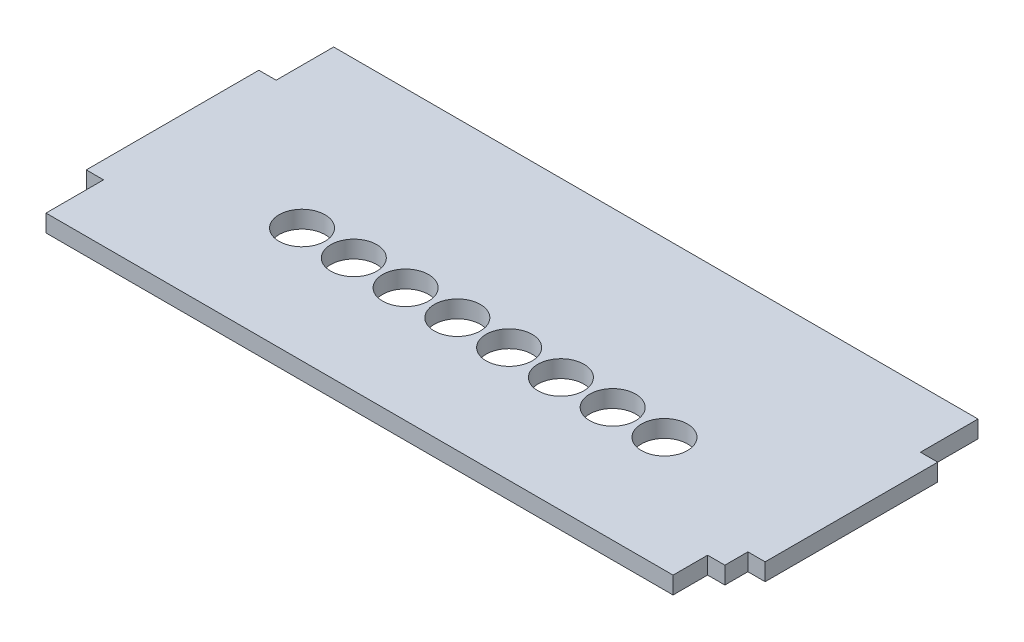
ISO-10303-21;
HEADER;
FILE_DESCRIPTION(('STEP AP214'),'2;1');
FILE_NAME('part.step','',(''),(''),'','','');
FILE_SCHEMA(('AUTOMOTIVE_DESIGN { 1 0 10303 214 1 1 1 1 }'));
ENDSEC;
DATA;
#1=APPLICATION_CONTEXT('core data for automotive mechanical design processes');
#2=APPLICATION_PROTOCOL_DEFINITION('international standard','automotive_design',2000,#1);
#3=PRODUCT_CONTEXT('',#1,'mechanical');
#4=PRODUCT('Part','Part','',(#3));
#5=PRODUCT_RELATED_PRODUCT_CATEGORY('part','',(#4));
#6=PRODUCT_DEFINITION_FORMATION('','',#4);
#7=PRODUCT_DEFINITION_CONTEXT('part definition',#1,'design');
#8=PRODUCT_DEFINITION('design','',#6,#7);
#9=PRODUCT_DEFINITION_SHAPE('','',#8);
#10=(LENGTH_UNIT() NAMED_UNIT(*) SI_UNIT(.MILLI.,.METRE.));
#11=(NAMED_UNIT(*) PLANE_ANGLE_UNIT() SI_UNIT($,.RADIAN.));
#12=(NAMED_UNIT(*) SI_UNIT($,.STERADIAN.) SOLID_ANGLE_UNIT());
#13=UNCERTAINTY_MEASURE_WITH_UNIT(LENGTH_MEASURE(1.E-05),#10,'distance_accuracy_value','');
#14=(GEOMETRIC_REPRESENTATION_CONTEXT(3) GLOBAL_UNCERTAINTY_ASSIGNED_CONTEXT((#13)) GLOBAL_UNIT_ASSIGNED_CONTEXT((#10,
#11,#12)) REPRESENTATION_CONTEXT('',''));
#15=CARTESIAN_POINT('',(0.,0.,0.));
#16=DIRECTION('',(0.,0.,1.));
#17=DIRECTION('',(1.,0.,0.));
#18=AXIS2_PLACEMENT_3D('',#15,#16,#17);
#19=CARTESIAN_POINT('',(-1.5404344466674E-12,12.,139.999999999999));
#20=DIRECTION('',(0.,0.,-1.));
#21=DIRECTION('',(-1.,0.,0.));
#22=AXIS2_PLACEMENT_3D('',#19,#20,#21);
#23=PLANE('',#22);
#24=DIRECTION('',(1.,0.,0.));
#25=VECTOR('',#24,1.);
#26=CARTESIAN_POINT('',(-1.5404344466674E-12,3.,139.999999999999));
#27=LINE('',#26,#25);
#28=CARTESIAN_POINT('',(-3.00000000000154,3.,139.999999999999));
#29=VERTEX_POINT('',#28);
#30=CARTESIAN_POINT('',(-1.5404344466674E-12,3.,139.999999999999));
#31=VERTEX_POINT('',#30);
#32=EDGE_CURVE('E48',#29,#31,#27,.T.);
#33=ORIENTED_EDGE('',*,*,#32,.F.);
#34=DIRECTION('',(0.,1.,0.));
#35=VECTOR('',#34,1.);
#36=CARTESIAN_POINT('',(-3.00000000000154,0.,139.999999999999));
#37=LINE('',#36,#35);
#38=CARTESIAN_POINT('',(-3.00000000000154,0.,139.999999999999));
#39=VERTEX_POINT('',#38);
#40=EDGE_CURVE('E177',#39,#29,#37,.T.);
#41=ORIENTED_EDGE('',*,*,#40,.F.);
#42=DIRECTION('',(1.,0.,0.));
#43=VECTOR('',#42,1.);
#44=CARTESIAN_POINT('',(-1.5404344466674E-12,0.,139.999999999999));
#45=LINE('',#44,#43);
#46=CARTESIAN_POINT('',(-1.5404344466674E-12,0.,139.999999999999));
#47=VERTEX_POINT('',#46);
#48=EDGE_CURVE('E193',#39,#47,#45,.T.);
#49=ORIENTED_EDGE('',*,*,#48,.T.);
#50=DIRECTION('',(0.,1.,0.));
#51=VECTOR('',#50,1.);
#52=CARTESIAN_POINT('',(-1.5404344466674E-12,0.,139.999999999999));
#53=LINE('',#52,#51);
#54=EDGE_CURVE('E240',#47,#31,#53,.T.);
#55=ORIENTED_EDGE('',*,*,#54,.T.);
#56=EDGE_LOOP('',(#33,#41,#49,#55));
#57=FACE_BOUND('',#56,.T.);
#58=ADVANCED_FACE('F34',(#57),#23,.F.);
#59=CARTESIAN_POINT('',(-1.62370117351429E-12,12.,109.999999999999));
#60=DIRECTION('',(0.,0.,-1.));
#61=DIRECTION('',(-1.,0.,0.));
#62=AXIS2_PLACEMENT_3D('',#59,#60,#61);
#63=PLANE('',#62);
#64=DIRECTION('',(0.,1.,0.));
#65=VECTOR('',#64,1.);
#66=CARTESIAN_POINT('',(-2.99999999999846,0.,109.999999999999));
#67=LINE('',#66,#65);
#68=CARTESIAN_POINT('',(-2.99999999999846,0.,109.999999999999));
#69=VERTEX_POINT('',#68);
#70=CARTESIAN_POINT('',(-2.99999999999846,3.,109.999999999999));
#71=VERTEX_POINT('',#70);
#72=EDGE_CURVE('E208',#69,#71,#67,.T.);
#73=ORIENTED_EDGE('',*,*,#72,.T.);
#74=DIRECTION('',(1.,0.,0.));
#75=VECTOR('',#74,1.);
#76=CARTESIAN_POINT('',(-1.62370117351429E-12,3.,109.999999999999));
#77=LINE('',#76,#75);
#78=CARTESIAN_POINT('',(-1.52395457364563E-12,3.,109.999999999999));
#79=VERTEX_POINT('',#78);
#80=EDGE_CURVE('E248',#71,#79,#77,.T.);
#81=ORIENTED_EDGE('',*,*,#80,.T.);
#82=DIRECTION('',(0.,1.,0.));
#83=VECTOR('',#82,1.);
#84=CARTESIAN_POINT('',(-3.05311331771916E-13,0.,109.999999999999));
#85=LINE('',#84,#83);
#86=CARTESIAN_POINT('',(-1.5404344466674E-12,0.,109.999999999999));
#87=VERTEX_POINT('',#86);
#88=EDGE_CURVE('E239',#87,#79,#85,.T.);
#89=ORIENTED_EDGE('',*,*,#88,.F.);
#90=DIRECTION('',(1.,0.,0.));
#91=VECTOR('',#90,1.);
#92=CARTESIAN_POINT('',(-1.62370117351429E-12,0.,109.999999999999));
#93=LINE('',#92,#91);
#94=EDGE_CURVE('E215',#69,#87,#93,.T.);
#95=ORIENTED_EDGE('',*,*,#94,.F.);
#96=EDGE_LOOP('',(#73,#81,#89,#95));
#97=FACE_BOUND('',#96,.T.);
#98=ADVANCED_FACE('F352',(#97),#63,.T.);
#99=CARTESIAN_POINT('',(-118.000000000001,12.,109.999999999999));
#100=DIRECTION('',(0.,0.,1.));
#101=DIRECTION('',(1.,0.,0.));
#102=AXIS2_PLACEMENT_3D('',#99,#100,#101);
#103=PLANE('',#102);
#104=DIRECTION('',(-1.,0.,0.));
#105=VECTOR('',#104,1.);
#106=CARTESIAN_POINT('',(-118.000000000001,3.,109.999999999999));
#107=LINE('',#106,#105);
#108=CARTESIAN_POINT('',(-115.000000000005,3.,109.999999999999));
#109=VERTEX_POINT('',#108);
#110=CARTESIAN_POINT('',(-118.000000000002,3.,109.999999999999));
#111=VERTEX_POINT('',#110);
#112=EDGE_CURVE('E132',#109,#111,#107,.T.);
#113=ORIENTED_EDGE('',*,*,#112,.F.);
#114=DIRECTION('',(0.,1.,0.));
#115=VECTOR('',#114,1.);
#116=CARTESIAN_POINT('',(-115.000000000005,0.,109.999999999999));
#117=LINE('',#116,#115);
#118=CARTESIAN_POINT('',(-115.000000000005,0.,109.999999999999));
#119=VERTEX_POINT('',#118);
#120=EDGE_CURVE('E206',#119,#109,#117,.T.);
#121=ORIENTED_EDGE('',*,*,#120,.F.);
#122=DIRECTION('',(-1.,0.,0.));
#123=VECTOR('',#122,1.);
#124=CARTESIAN_POINT('',(-118.000000000001,0.,109.999999999999));
#125=LINE('',#124,#123);
#126=CARTESIAN_POINT('',(-118.000000000001,0.,109.999999999999));
#127=VERTEX_POINT('',#126);
#128=EDGE_CURVE('E157',#119,#127,#125,.T.);
#129=ORIENTED_EDGE('',*,*,#128,.T.);
#130=DIRECTION('',(0.,1.,0.));
#131=VECTOR('',#130,1.);
#132=CARTESIAN_POINT('',(-118.000000000001,0.,109.999999999999));
#133=LINE('',#132,#131);
#134=EDGE_CURVE('E148',#127,#111,#133,.T.);
#135=ORIENTED_EDGE('',*,*,#134,.T.);
#136=EDGE_LOOP('',(#113,#121,#129,#135));
#137=FACE_BOUND('',#136,.T.);
#138=ADVANCED_FACE('F156',(#137),#103,.F.);
#139=CARTESIAN_POINT('',(-118.000000000002,12.,139.999999999999));
#140=DIRECTION('',(0.,0.,1.));
#141=DIRECTION('',(1.,0.,0.));
#142=AXIS2_PLACEMENT_3D('',#139,#140,#141);
#143=PLANE('',#142);
#144=DIRECTION('',(0.,1.,0.));
#145=VECTOR('',#144,1.);
#146=CARTESIAN_POINT('',(-115.000000000002,0.,139.999999999999));
#147=LINE('',#146,#145);
#148=CARTESIAN_POINT('',(-115.000000000002,0.,139.999999999999));
#149=VERTEX_POINT('',#148);
#150=CARTESIAN_POINT('',(-115.000000000002,3.,139.999999999999));
#151=VERTEX_POINT('',#150);
#152=EDGE_CURVE('E188',#149,#151,#147,.T.);
#153=ORIENTED_EDGE('',*,*,#152,.T.);
#154=DIRECTION('',(-1.,0.,0.));
#155=VECTOR('',#154,1.);
#156=CARTESIAN_POINT('',(-118.000000000002,3.,139.999999999999));
#157=LINE('',#156,#155);
#158=CARTESIAN_POINT('',(-118.000000000002,3.,139.999999999999));
#159=VERTEX_POINT('',#158);
#160=EDGE_CURVE('E237',#151,#159,#157,.T.);
#161=ORIENTED_EDGE('',*,*,#160,.T.);
#162=DIRECTION('',(0.,1.,0.));
#163=VECTOR('',#162,1.);
#164=CARTESIAN_POINT('',(-118.000000000002,0.,139.999999999999));
#165=LINE('',#164,#163);
#166=CARTESIAN_POINT('',(-118.000000000001,0.,139.999999999999));
#167=VERTEX_POINT('',#166);
#168=EDGE_CURVE('E151',#167,#159,#165,.T.);
#169=ORIENTED_EDGE('',*,*,#168,.F.);
#170=DIRECTION('',(-1.,0.,0.));
#171=VECTOR('',#170,1.);
#172=CARTESIAN_POINT('',(-118.000000000002,0.,139.999999999999));
#173=LINE('',#172,#171);
#174=EDGE_CURVE('E219',#149,#167,#173,.T.);
#175=ORIENTED_EDGE('',*,*,#174,.F.);
#176=EDGE_LOOP('',(#153,#161,#169,#175));
#177=FACE_BOUND('',#176,.T.);
#178=ADVANCED_FACE('F236',(#177),#143,.T.);
#179=CARTESIAN_POINT('',(-1.5404344466674E-12,12.,149.999999999999));
#180=DIRECTION('',(0.,0.,1.));
#181=DIRECTION('',(1.,0.,0.));
#182=AXIS2_PLACEMENT_3D('',#179,#180,#181);
#183=PLANE('',#182);
#184=DIRECTION('',(0.,1.,0.));
#185=VECTOR('',#184,1.);
#186=CARTESIAN_POINT('',(-6.00197015274353,0.,149.999999999999));
#187=LINE('',#186,#185);
#188=CARTESIAN_POINT('',(-6.00197015274353,0.,149.999999999999));
#189=VERTEX_POINT('',#188);
#190=CARTESIAN_POINT('',(-6.00197015274354,3.,149.999999999999));
#191=VERTEX_POINT('',#190);
#192=EDGE_CURVE('E180',#189,#191,#187,.T.);
#193=ORIENTED_EDGE('',*,*,#192,.T.);
#194=DIRECTION('',(1.,0.,0.));
#195=VECTOR('',#194,1.);
#196=CARTESIAN_POINT('',(-118.000000000002,3.,149.999999999999));
#197=LINE('',#196,#195);
#198=CARTESIAN_POINT('',(-115.000000000002,3.,149.999999999999));
#199=VERTEX_POINT('',#198);
#200=EDGE_CURVE('E152',#199,#191,#197,.T.);
#201=ORIENTED_EDGE('',*,*,#200,.F.);
#202=DIRECTION('',(0.,1.,0.));
#203=VECTOR('',#202,1.);
#204=CARTESIAN_POINT('',(-115.000000000002,0.,149.999999999999));
#205=LINE('',#204,#203);
#206=CARTESIAN_POINT('',(-115.000000000002,0.,149.999999999999));
#207=VERTEX_POINT('',#206);
#208=EDGE_CURVE('E190',#207,#199,#205,.T.);
#209=ORIENTED_EDGE('',*,*,#208,.F.);
#210=DIRECTION('',(-1.,0.,0.));
#211=VECTOR('',#210,1.);
#212=CARTESIAN_POINT('',(-1.5404344466674E-12,0.,149.999999999999));
#213=LINE('',#212,#211);
#214=EDGE_CURVE('E41',#189,#207,#213,.T.);
#215=ORIENTED_EDGE('',*,*,#214,.F.);
#216=EDGE_LOOP('',(#193,#201,#209,#215));
#217=FACE_BOUND('',#216,.T.);
#218=ADVANCED_FACE('F229',(#217),#183,.T.);
#219=CARTESIAN_POINT('',(-115.000000000002,0.,0.));
#220=DIRECTION('',(1.,0.,0.));
#221=DIRECTION('',(0.,0.,-1.));
#222=AXIS2_PLACEMENT_3D('',#219,#220,#221);
#223=PLANE('',#222);
#224=DIRECTION('',(0.,0.,1.));
#225=VECTOR('',#224,1.);
#226=CARTESIAN_POINT('',(-115.000000000002,3.,0.));
#227=LINE('',#226,#225);
#228=EDGE_CURVE('E143',#151,#199,#227,.T.);
#229=ORIENTED_EDGE('',*,*,#228,.F.);
#230=ORIENTED_EDGE('',*,*,#152,.F.);
#231=DIRECTION('',(0.,0.,-1.));
#232=VECTOR('',#231,1.);
#233=CARTESIAN_POINT('',(-115.000000000002,0.,0.));
#234=LINE('',#233,#232);
#235=EDGE_CURVE('E185',#207,#149,#234,.T.);
#236=ORIENTED_EDGE('',*,*,#235,.F.);
#237=ORIENTED_EDGE('',*,*,#208,.T.);
#238=EDGE_LOOP('',(#229,#230,#236,#237));
#239=FACE_BOUND('',#238,.T.);
#240=ADVANCED_FACE('F233',(#239),#223,.F.);
#241=CARTESIAN_POINT('',(0.,0.,99.9999999999988));
#242=DIRECTION('',(0.,0.,-1.));
#243=DIRECTION('',(-1.,0.,0.));
#244=AXIS2_PLACEMENT_3D('',#241,#242,#243);
#245=PLANE('',#244);
#246=DIRECTION('',(0.,1.,0.));
#247=VECTOR('',#246,1.);
#248=CARTESIAN_POINT('',(-115.000000000005,0.,99.9999999999988));
#249=LINE('',#248,#247);
#250=CARTESIAN_POINT('',(-115.000000000005,0.,99.9999999999988));
#251=VERTEX_POINT('',#250);
#252=CARTESIAN_POINT('',(-115.000000000005,3.,99.9999999999988));
#253=VERTEX_POINT('',#252);
#254=EDGE_CURVE('E189',#251,#253,#249,.T.);
#255=ORIENTED_EDGE('',*,*,#254,.T.);
#256=DIRECTION('',(-1.,0.,0.));
#257=VECTOR('',#256,1.);
#258=CARTESIAN_POINT('',(-118.000000000002,3.,99.9999999999988));
#259=LINE('',#258,#257);
#260=CARTESIAN_POINT('',(-2.99999999999846,3.,99.9999999999988));
#261=VERTEX_POINT('',#260);
#262=EDGE_CURVE('E262',#261,#253,#259,.T.);
#263=ORIENTED_EDGE('',*,*,#262,.F.);
#264=DIRECTION('',(0.,1.,0.));
#265=VECTOR('',#264,1.);
#266=CARTESIAN_POINT('',(-2.99999999999846,0.,99.9999999999988));
#267=LINE('',#266,#265);
#268=CARTESIAN_POINT('',(-2.99999999999846,0.,99.9999999999988));
#269=VERTEX_POINT('',#268);
#270=EDGE_CURVE('E203',#269,#261,#267,.T.);
#271=ORIENTED_EDGE('',*,*,#270,.F.);
#272=DIRECTION('',(-1.,0.,0.));
#273=VECTOR('',#272,1.);
#274=CARTESIAN_POINT('',(0.,0.,99.9999999999988));
#275=LINE('',#274,#273);
#276=EDGE_CURVE('E176',#269,#251,#275,.T.);
#277=ORIENTED_EDGE('',*,*,#276,.T.);
#278=EDGE_LOOP('',(#255,#263,#271,#277));
#279=FACE_BOUND('',#278,.T.);
#280=ADVANCED_FACE('F371',(#279),#245,.T.);
#281=CARTESIAN_POINT('',(-115.000000000005,0.,0.));
#282=DIRECTION('',(-1.,0.,0.));
#283=DIRECTION('',(0.,0.,1.));
#284=AXIS2_PLACEMENT_3D('',#281,#282,#283);
#285=PLANE('',#284);
#286=ORIENTED_EDGE('',*,*,#120,.T.);
#287=DIRECTION('',(0.,0.,-1.));
#288=VECTOR('',#287,1.);
#289=CARTESIAN_POINT('',(-115.000000000005,3.,0.));
#290=LINE('',#289,#288);
#291=EDGE_CURVE('E138',#109,#253,#290,.T.);
#292=ORIENTED_EDGE('',*,*,#291,.T.);
#293=ORIENTED_EDGE('',*,*,#254,.F.);
#294=DIRECTION('',(0.,0.,1.));
#295=VECTOR('',#294,1.);
#296=CARTESIAN_POINT('',(-115.000000000005,0.,0.));
#297=LINE('',#296,#295);
#298=EDGE_CURVE('E200',#251,#119,#297,.T.);
#299=ORIENTED_EDGE('',*,*,#298,.T.);
#300=EDGE_LOOP('',(#286,#292,#293,#299));
#301=FACE_BOUND('',#300,.T.);
#302=ADVANCED_FACE('F374',(#301),#285,.T.);
#303=CARTESIAN_POINT('',(-2.99999999999846,0.,0.));
#304=DIRECTION('',(-1.,0.,0.));
#305=DIRECTION('',(0.,0.,1.));
#306=AXIS2_PLACEMENT_3D('',#303,#304,#305);
#307=PLANE('',#306);
#308=DIRECTION('',(0.,0.,-1.));
#309=VECTOR('',#308,1.);
#310=CARTESIAN_POINT('',(-2.99999999999846,3.,0.));
#311=LINE('',#310,#309);
#312=EDGE_CURVE('E251',#71,#261,#311,.T.);
#313=ORIENTED_EDGE('',*,*,#312,.F.);
#314=ORIENTED_EDGE('',*,*,#72,.F.);
#315=DIRECTION('',(0.,0.,1.));
#316=VECTOR('',#315,1.);
#317=CARTESIAN_POINT('',(-2.99999999999846,0.,0.));
#318=LINE('',#317,#316);
#319=EDGE_CURVE('E197',#269,#69,#318,.T.);
#320=ORIENTED_EDGE('',*,*,#319,.F.);
#321=ORIENTED_EDGE('',*,*,#270,.T.);
#322=EDGE_LOOP('',(#313,#314,#320,#321));
#323=FACE_BOUND('',#322,.T.);
#324=ADVANCED_FACE('F368',(#323),#307,.F.);
#325=CARTESIAN_POINT('',(0.,0.,143.999999999999));
#326=DIRECTION('',(0.,0.,1.));
#327=DIRECTION('',(1.,0.,0.));
#328=AXIS2_PLACEMENT_3D('',#325,#326,#327);
#329=PLANE('',#328);
#330=DIRECTION('',(0.,1.,0.));
#331=VECTOR('',#330,1.);
#332=CARTESIAN_POINT('',(-3.00000000000154,0.,143.999999999999));
#333=LINE('',#332,#331);
#334=CARTESIAN_POINT('',(-3.00000000000154,0.,143.999999999999));
#335=VERTEX_POINT('',#334);
#336=CARTESIAN_POINT('',(-3.00000000000154,3.,143.999999999999));
#337=VERTEX_POINT('',#336);
#338=EDGE_CURVE('E173',#335,#337,#333,.T.);
#339=ORIENTED_EDGE('',*,*,#338,.T.);
#340=DIRECTION('',(-1.,0.,0.));
#341=VECTOR('',#340,1.);
#342=CARTESIAN_POINT('',(0.,3.,143.999999999999));
#343=LINE('',#342,#341);
#344=CARTESIAN_POINT('',(-6.00197015274353,3.,143.999999999999));
#345=VERTEX_POINT('',#344);
#346=EDGE_CURVE('E257',#337,#345,#343,.T.);
#347=ORIENTED_EDGE('',*,*,#346,.T.);
#348=DIRECTION('',(0.,1.,0.));
#349=VECTOR('',#348,1.);
#350=CARTESIAN_POINT('',(-6.00197015274353,0.,143.999999999999));
#351=LINE('',#350,#349);
#352=CARTESIAN_POINT('',(-6.00197015274353,0.,143.999999999999));
#353=VERTEX_POINT('',#352);
#354=EDGE_CURVE('E172',#353,#345,#351,.T.);
#355=ORIENTED_EDGE('',*,*,#354,.F.);
#356=DIRECTION('',(1.,0.,0.));
#357=VECTOR('',#356,1.);
#358=CARTESIAN_POINT('',(0.,0.,143.999999999999));
#359=LINE('',#358,#357);
#360=EDGE_CURVE('E158',#353,#335,#359,.T.);
#361=ORIENTED_EDGE('',*,*,#360,.T.);
#362=EDGE_LOOP('',(#339,#347,#355,#361));
#363=FACE_BOUND('',#362,.T.);
#364=ADVANCED_FACE('F381',(#363),#329,.T.);
#365=CARTESIAN_POINT('',(-3.00000000000154,0.,0.));
#366=DIRECTION('',(1.,0.,0.));
#367=DIRECTION('',(0.,0.,-1.));
#368=AXIS2_PLACEMENT_3D('',#365,#366,#367);
#369=PLANE('',#368);
#370=ORIENTED_EDGE('',*,*,#40,.T.);
#371=DIRECTION('',(0.,0.,1.));
#372=VECTOR('',#371,1.);
#373=CARTESIAN_POINT('',(-3.00000000000154,3.,0.));
#374=LINE('',#373,#372);
#375=EDGE_CURVE('E254',#29,#337,#374,.T.);
#376=ORIENTED_EDGE('',*,*,#375,.T.);
#377=ORIENTED_EDGE('',*,*,#338,.F.);
#378=DIRECTION('',(0.,0.,-1.));
#379=VECTOR('',#378,1.);
#380=CARTESIAN_POINT('',(-3.00000000000154,0.,0.));
#381=LINE('',#380,#379);
#382=EDGE_CURVE('E169',#335,#39,#381,.T.);
#383=ORIENTED_EDGE('',*,*,#382,.T.);
#384=EDGE_LOOP('',(#370,#376,#377,#383));
#385=FACE_BOUND('',#384,.T.);
#386=ADVANCED_FACE('F360',(#385),#369,.T.);
#387=CARTESIAN_POINT('',(-6.00197015274355,0.,0.));
#388=DIRECTION('',(-1.,0.,0.));
#389=DIRECTION('',(0.,0.,1.));
#390=AXIS2_PLACEMENT_3D('',#387,#388,#389);
#391=PLANE('',#390);
#392=DIRECTION('',(0.,0.,-1.));
#393=VECTOR('',#392,1.);
#394=CARTESIAN_POINT('',(-6.00197015274355,3.,0.));
#395=LINE('',#394,#393);
#396=EDGE_CURVE('E260',#191,#345,#395,.T.);
#397=ORIENTED_EDGE('',*,*,#396,.F.);
#398=ORIENTED_EDGE('',*,*,#192,.F.);
#399=DIRECTION('',(0.,0.,1.));
#400=VECTOR('',#399,1.);
#401=CARTESIAN_POINT('',(-6.00197015274355,0.,0.));
#402=LINE('',#401,#400);
#403=EDGE_CURVE('E160',#353,#189,#402,.T.);
#404=ORIENTED_EDGE('',*,*,#403,.F.);
#405=ORIENTED_EDGE('',*,*,#354,.T.);
#406=EDGE_LOOP('',(#397,#398,#404,#405));
#407=FACE_BOUND('',#406,.T.);
#408=ADVANCED_FACE('F451',(#407),#391,.F.);
#409=CARTESIAN_POINT('',(-118.000000000002,0.,0.));
#410=DIRECTION('',(1.,0.,0.));
#411=DIRECTION('',(0.,0.,-1.));
#412=AXIS2_PLACEMENT_3D('',#409,#410,#411);
#413=PLANE('',#412);
#414=DIRECTION('',(0.,0.,1.));
#415=VECTOR('',#414,1.);
#416=CARTESIAN_POINT('',(-118.000000000002,3.,99.9999999999988));
#417=LINE('',#416,#415);
#418=EDGE_CURVE('E135',#111,#159,#417,.T.);
#419=ORIENTED_EDGE('',*,*,#418,.F.);
#420=ORIENTED_EDGE('',*,*,#134,.F.);
#421=DIRECTION('',(0.,0.,-1.));
#422=VECTOR('',#421,1.);
#423=CARTESIAN_POINT('',(-118.000000000002,0.,0.));
#424=LINE('',#423,#422);
#425=EDGE_CURVE('E162',#167,#127,#424,.T.);
#426=ORIENTED_EDGE('',*,*,#425,.F.);
#427=ORIENTED_EDGE('',*,*,#168,.T.);
#428=EDGE_LOOP('',(#419,#420,#426,#427));
#429=FACE_BOUND('',#428,.T.);
#430=ADVANCED_FACE('F147',(#429),#413,.F.);
#431=CARTESIAN_POINT('',(0.,0.,0.));
#432=DIRECTION('',(1.,0.,0.));
#433=DIRECTION('',(0.,0.,-1.));
#434=AXIS2_PLACEMENT_3D('',#431,#432,#433);
#435=PLANE('',#434);
#436=ORIENTED_EDGE('',*,*,#88,.T.);
#437=DIRECTION('',(0.,0.,1.));
#438=VECTOR('',#437,1.);
#439=CARTESIAN_POINT('',(0.,3.,0.));
#440=LINE('',#439,#438);
#441=EDGE_CURVE('E11',#79,#31,#440,.T.);
#442=ORIENTED_EDGE('',*,*,#441,.T.);
#443=ORIENTED_EDGE('',*,*,#54,.F.);
#444=DIRECTION('',(0.,0.,-1.));
#445=VECTOR('',#444,1.);
#446=CARTESIAN_POINT('',(0.,0.,0.));
#447=LINE('',#446,#445);
#448=EDGE_CURVE('E55',#47,#87,#447,.T.);
#449=ORIENTED_EDGE('',*,*,#448,.T.);
#450=EDGE_LOOP('',(#436,#442,#443,#449));
#451=FACE_BOUND('',#450,.T.);
#452=ADVANCED_FACE('F389',(#451),#435,.T.);
#453=CARTESIAN_POINT('',(0.,0.,0.));
#454=DIRECTION('',(0.,-1.,0.));
#455=DIRECTION('',(0.,0.,-1.));
#456=AXIS2_PLACEMENT_3D('',#453,#454,#455);
#457=PLANE('',#456);
#458=CARTESIAN_POINT('',(-90.5000000000015,0.,129.999999999999));
#459=DIRECTION('',(0.,1.,0.));
#460=DIRECTION('',(0.,0.,1.));
#461=AXIS2_PLACEMENT_3D('',#458,#459,#460);
#462=CIRCLE('',#461,4.00000000000001);
#463=CARTESIAN_POINT('',(-90.5000000000015,0.,133.999999999999));
#464=VERTEX_POINT('',#463);
#465=EDGE_CURVE('E153',#464,#464,#462,.T.);
#466=ORIENTED_EDGE('',*,*,#465,.T.);
#467=EDGE_LOOP('',(#466));
#468=FACE_BOUND('',#467,.T.);
#469=CARTESIAN_POINT('',(-81.5000000000015,0.,129.999999999999));
#470=DIRECTION('',(0.,1.,0.));
#471=DIRECTION('',(0.,0.,1.));
#472=AXIS2_PLACEMENT_3D('',#469,#470,#471);
#473=CIRCLE('',#472,4.00000000000001);
#474=CARTESIAN_POINT('',(-81.5000000000015,0.,133.999999999999));
#475=VERTEX_POINT('',#474);
#476=EDGE_CURVE('E304',#475,#475,#473,.T.);
#477=ORIENTED_EDGE('',*,*,#476,.T.);
#478=EDGE_LOOP('',(#477));
#479=FACE_BOUND('',#478,.T.);
#480=CARTESIAN_POINT('',(-72.5000000000015,0.,129.999999999999));
#481=DIRECTION('',(0.,1.,0.));
#482=DIRECTION('',(0.,0.,1.));
#483=AXIS2_PLACEMENT_3D('',#480,#481,#482);
#484=CIRCLE('',#483,4.00000000000001);
#485=CARTESIAN_POINT('',(-72.5000000000015,0.,133.999999999999));
#486=VERTEX_POINT('',#485);
#487=EDGE_CURVE('E298',#486,#486,#484,.T.);
#488=ORIENTED_EDGE('',*,*,#487,.T.);
#489=EDGE_LOOP('',(#488));
#490=FACE_BOUND('',#489,.T.);
#491=CARTESIAN_POINT('',(-63.5000000000015,0.,129.999999999999));
#492=DIRECTION('',(0.,1.,0.));
#493=DIRECTION('',(0.,0.,1.));
#494=AXIS2_PLACEMENT_3D('',#491,#492,#493);
#495=CIRCLE('',#494,4.00000000000001);
#496=CARTESIAN_POINT('',(-63.5000000000015,0.,133.999999999999));
#497=VERTEX_POINT('',#496);
#498=EDGE_CURVE('E292',#497,#497,#495,.T.);
#499=ORIENTED_EDGE('',*,*,#498,.T.);
#500=EDGE_LOOP('',(#499));
#501=FACE_BOUND('',#500,.T.);
#502=CARTESIAN_POINT('',(-54.5000000000015,0.,129.999999999999));
#503=DIRECTION('',(0.,1.,0.));
#504=DIRECTION('',(0.,0.,1.));
#505=AXIS2_PLACEMENT_3D('',#502,#503,#504);
#506=CIRCLE('',#505,4.);
#507=CARTESIAN_POINT('',(-54.5000000000015,0.,133.999999999999));
#508=VERTEX_POINT('',#507);
#509=EDGE_CURVE('E286',#508,#508,#506,.T.);
#510=ORIENTED_EDGE('',*,*,#509,.T.);
#511=EDGE_LOOP('',(#510));
#512=FACE_BOUND('',#511,.T.);
#513=CARTESIAN_POINT('',(-45.5000000000015,0.,129.999999999999));
#514=DIRECTION('',(0.,1.,0.));
#515=DIRECTION('',(0.,0.,1.));
#516=AXIS2_PLACEMENT_3D('',#513,#514,#515);
#517=CIRCLE('',#516,4.00000000000001);
#518=CARTESIAN_POINT('',(-45.5000000000015,0.,133.999999999999));
#519=VERTEX_POINT('',#518);
#520=EDGE_CURVE('E280',#519,#519,#517,.T.);
#521=ORIENTED_EDGE('',*,*,#520,.T.);
#522=EDGE_LOOP('',(#521));
#523=FACE_BOUND('',#522,.T.);
#524=CARTESIAN_POINT('',(-36.5000000000015,0.,129.999999999999));
#525=DIRECTION('',(0.,1.,0.));
#526=DIRECTION('',(0.,0.,1.));
#527=AXIS2_PLACEMENT_3D('',#524,#525,#526);
#528=CIRCLE('',#527,4.00000000000001);
#529=CARTESIAN_POINT('',(-36.5000000000015,0.,133.999999999999));
#530=VERTEX_POINT('',#529);
#531=EDGE_CURVE('E274',#530,#530,#528,.T.);
#532=ORIENTED_EDGE('',*,*,#531,.T.);
#533=EDGE_LOOP('',(#532));
#534=FACE_BOUND('',#533,.T.);
#535=CARTESIAN_POINT('',(-27.5000000000015,0.,129.999999999999));
#536=DIRECTION('',(0.,1.,0.));
#537=DIRECTION('',(0.,0.,1.));
#538=AXIS2_PLACEMENT_3D('',#535,#536,#537);
#539=CIRCLE('',#538,4.);
#540=CARTESIAN_POINT('',(-27.5000000000015,0.,133.999999999999));
#541=VERTEX_POINT('',#540);
#542=EDGE_CURVE('E268',#541,#541,#539,.T.);
#543=ORIENTED_EDGE('',*,*,#542,.T.);
#544=EDGE_LOOP('',(#543));
#545=FACE_BOUND('',#544,.T.);
#546=ORIENTED_EDGE('',*,*,#94,.T.);
#547=ORIENTED_EDGE('',*,*,#448,.F.);
#548=ORIENTED_EDGE('',*,*,#48,.F.);
#549=ORIENTED_EDGE('',*,*,#382,.F.);
#550=ORIENTED_EDGE('',*,*,#360,.F.);
#551=ORIENTED_EDGE('',*,*,#403,.T.);
#552=ORIENTED_EDGE('',*,*,#214,.T.);
#553=ORIENTED_EDGE('',*,*,#235,.T.);
#554=ORIENTED_EDGE('',*,*,#174,.T.);
#555=ORIENTED_EDGE('',*,*,#425,.T.);
#556=ORIENTED_EDGE('',*,*,#128,.F.);
#557=ORIENTED_EDGE('',*,*,#298,.F.);
#558=ORIENTED_EDGE('',*,*,#276,.F.);
#559=ORIENTED_EDGE('',*,*,#319,.T.);
#560=EDGE_LOOP('',(#546,#547,#548,#549,#550,#551,#552,#553,#554,#555,#556,#557,#558,#559));
#561=FACE_BOUND('',#560,.T.);
#562=ADVANCED_FACE('F224',(#468,#479,#490,#501,#512,#523,#534,#545,#561),#457,.T.);
#563=CARTESIAN_POINT('',(0.,3.,0.));
#564=DIRECTION('',(0.,1.,0.));
#565=DIRECTION('',(0.,0.,1.));
#566=AXIS2_PLACEMENT_3D('',#563,#564,#565);
#567=PLANE('',#566);
#568=CARTESIAN_POINT('',(-90.5000000000015,3.,129.999999999999));
#569=DIRECTION('',(0.,1.,0.));
#570=DIRECTION('',(0.,0.,1.));
#571=AXIS2_PLACEMENT_3D('',#568,#569,#570);
#572=CIRCLE('',#571,4.00000000000001);
#573=CARTESIAN_POINT('',(-90.5000000000015,3.,133.999999999999));
#574=VERTEX_POINT('',#573);
#575=EDGE_CURVE('E307',#574,#574,#572,.T.);
#576=ORIENTED_EDGE('',*,*,#575,.F.);
#577=EDGE_LOOP('',(#576));
#578=FACE_BOUND('',#577,.T.);
#579=CARTESIAN_POINT('',(-81.5000000000015,3.,129.999999999999));
#580=DIRECTION('',(0.,1.,0.));
#581=DIRECTION('',(0.,0.,1.));
#582=AXIS2_PLACEMENT_3D('',#579,#580,#581);
#583=CIRCLE('',#582,4.00000000000001);
#584=CARTESIAN_POINT('',(-81.5000000000015,3.,133.999999999999));
#585=VERTEX_POINT('',#584);
#586=EDGE_CURVE('E301',#585,#585,#583,.T.);
#587=ORIENTED_EDGE('',*,*,#586,.F.);
#588=EDGE_LOOP('',(#587));
#589=FACE_BOUND('',#588,.T.);
#590=CARTESIAN_POINT('',(-72.5000000000015,3.,129.999999999999));
#591=DIRECTION('',(0.,1.,0.));
#592=DIRECTION('',(0.,0.,1.));
#593=AXIS2_PLACEMENT_3D('',#590,#591,#592);
#594=CIRCLE('',#593,4.00000000000001);
#595=CARTESIAN_POINT('',(-72.5000000000015,3.,133.999999999999));
#596=VERTEX_POINT('',#595);
#597=EDGE_CURVE('E295',#596,#596,#594,.T.);
#598=ORIENTED_EDGE('',*,*,#597,.F.);
#599=EDGE_LOOP('',(#598));
#600=FACE_BOUND('',#599,.T.);
#601=CARTESIAN_POINT('',(-63.5000000000015,3.,129.999999999999));
#602=DIRECTION('',(0.,1.,0.));
#603=DIRECTION('',(0.,0.,1.));
#604=AXIS2_PLACEMENT_3D('',#601,#602,#603);
#605=CIRCLE('',#604,4.00000000000001);
#606=CARTESIAN_POINT('',(-63.5000000000015,3.,133.999999999999));
#607=VERTEX_POINT('',#606);
#608=EDGE_CURVE('E289',#607,#607,#605,.T.);
#609=ORIENTED_EDGE('',*,*,#608,.F.);
#610=EDGE_LOOP('',(#609));
#611=FACE_BOUND('',#610,.T.);
#612=CARTESIAN_POINT('',(-54.5000000000015,3.,129.999999999999));
#613=DIRECTION('',(0.,1.,0.));
#614=DIRECTION('',(0.,0.,1.));
#615=AXIS2_PLACEMENT_3D('',#612,#613,#614);
#616=CIRCLE('',#615,4.);
#617=CARTESIAN_POINT('',(-54.5000000000015,3.,133.999999999999));
#618=VERTEX_POINT('',#617);
#619=EDGE_CURVE('E283',#618,#618,#616,.T.);
#620=ORIENTED_EDGE('',*,*,#619,.F.);
#621=EDGE_LOOP('',(#620));
#622=FACE_BOUND('',#621,.T.);
#623=CARTESIAN_POINT('',(-45.5000000000015,3.,129.999999999999));
#624=DIRECTION('',(0.,1.,0.));
#625=DIRECTION('',(0.,0.,1.));
#626=AXIS2_PLACEMENT_3D('',#623,#624,#625);
#627=CIRCLE('',#626,4.00000000000001);
#628=CARTESIAN_POINT('',(-45.5000000000015,3.,133.999999999999));
#629=VERTEX_POINT('',#628);
#630=EDGE_CURVE('E277',#629,#629,#627,.T.);
#631=ORIENTED_EDGE('',*,*,#630,.F.);
#632=EDGE_LOOP('',(#631));
#633=FACE_BOUND('',#632,.T.);
#634=CARTESIAN_POINT('',(-36.5000000000015,3.,129.999999999999));
#635=DIRECTION('',(0.,1.,0.));
#636=DIRECTION('',(0.,0.,1.));
#637=AXIS2_PLACEMENT_3D('',#634,#635,#636);
#638=CIRCLE('',#637,4.00000000000001);
#639=CARTESIAN_POINT('',(-36.5000000000015,3.,133.999999999999));
#640=VERTEX_POINT('',#639);
#641=EDGE_CURVE('E271',#640,#640,#638,.T.);
#642=ORIENTED_EDGE('',*,*,#641,.F.);
#643=EDGE_LOOP('',(#642));
#644=FACE_BOUND('',#643,.T.);
#645=CARTESIAN_POINT('',(-27.5000000000015,3.,129.999999999999));
#646=DIRECTION('',(0.,1.,0.));
#647=DIRECTION('',(0.,0.,1.));
#648=AXIS2_PLACEMENT_3D('',#645,#646,#647);
#649=CIRCLE('',#648,4.);
#650=CARTESIAN_POINT('',(-27.5000000000015,3.,133.999999999999));
#651=VERTEX_POINT('',#650);
#652=EDGE_CURVE('E265',#651,#651,#649,.T.);
#653=ORIENTED_EDGE('',*,*,#652,.F.);
#654=EDGE_LOOP('',(#653));
#655=FACE_BOUND('',#654,.T.);
#656=ORIENTED_EDGE('',*,*,#228,.T.);
#657=ORIENTED_EDGE('',*,*,#200,.T.);
#658=ORIENTED_EDGE('',*,*,#396,.T.);
#659=ORIENTED_EDGE('',*,*,#346,.F.);
#660=ORIENTED_EDGE('',*,*,#375,.F.);
#661=ORIENTED_EDGE('',*,*,#32,.T.);
#662=ORIENTED_EDGE('',*,*,#441,.F.);
#663=ORIENTED_EDGE('',*,*,#80,.F.);
#664=ORIENTED_EDGE('',*,*,#312,.T.);
#665=ORIENTED_EDGE('',*,*,#262,.T.);
#666=ORIENTED_EDGE('',*,*,#291,.F.);
#667=ORIENTED_EDGE('',*,*,#112,.T.);
#668=ORIENTED_EDGE('',*,*,#418,.T.);
#669=ORIENTED_EDGE('',*,*,#160,.F.);
#670=EDGE_LOOP('',(#656,#657,#658,#659,#660,#661,#662,#663,#664,#665,#666,#667,#668,#669));
#671=FACE_BOUND('',#670,.T.);
#672=ADVANCED_FACE('F134',(#578,#589,#600,#611,#622,#633,#644,#655,#671),#567,.T.);
#673=CARTESIAN_POINT('',(-27.5000000000015,0.,129.999999999999));
#674=DIRECTION('',(0.,1.,0.));
#675=DIRECTION('',(0.,0.,1.));
#676=AXIS2_PLACEMENT_3D('',#673,#674,#675);
#677=CYLINDRICAL_SURFACE('',#676,4.);
#678=ORIENTED_EDGE('',*,*,#542,.F.);
#679=EDGE_LOOP('',(#678));
#680=FACE_BOUND('',#679,.T.);
#681=ORIENTED_EDGE('',*,*,#652,.T.);
#682=EDGE_LOOP('',(#681));
#683=FACE_BOUND('',#682,.T.);
#684=ADVANCED_FACE('F324',(#680,#683),#677,.F.);
#685=CARTESIAN_POINT('',(-36.5000000000015,0.,129.999999999999));
#686=DIRECTION('',(0.,1.,0.));
#687=DIRECTION('',(0.,0.,1.));
#688=AXIS2_PLACEMENT_3D('',#685,#686,#687);
#689=CYLINDRICAL_SURFACE('',#688,4.00000000000001);
#690=ORIENTED_EDGE('',*,*,#531,.F.);
#691=EDGE_LOOP('',(#690));
#692=FACE_BOUND('',#691,.T.);
#693=ORIENTED_EDGE('',*,*,#641,.T.);
#694=EDGE_LOOP('',(#693));
#695=FACE_BOUND('',#694,.T.);
#696=ADVANCED_FACE('F341',(#692,#695),#689,.F.);
#697=CARTESIAN_POINT('',(-45.5000000000015,0.,129.999999999999));
#698=DIRECTION('',(0.,1.,0.));
#699=DIRECTION('',(0.,0.,1.));
#700=AXIS2_PLACEMENT_3D('',#697,#698,#699);
#701=CYLINDRICAL_SURFACE('',#700,4.00000000000001);
#702=ORIENTED_EDGE('',*,*,#520,.F.);
#703=EDGE_LOOP('',(#702));
#704=FACE_BOUND('',#703,.T.);
#705=ORIENTED_EDGE('',*,*,#630,.T.);
#706=EDGE_LOOP('',(#705));
#707=FACE_BOUND('',#706,.T.);
#708=ADVANCED_FACE('F347',(#704,#707),#701,.F.);
#709=CARTESIAN_POINT('',(-54.5000000000015,0.,129.999999999999));
#710=DIRECTION('',(0.,1.,0.));
#711=DIRECTION('',(0.,0.,1.));
#712=AXIS2_PLACEMENT_3D('',#709,#710,#711);
#713=CYLINDRICAL_SURFACE('',#712,4.);
#714=ORIENTED_EDGE('',*,*,#509,.F.);
#715=EDGE_LOOP('',(#714));
#716=FACE_BOUND('',#715,.T.);
#717=ORIENTED_EDGE('',*,*,#619,.T.);
#718=EDGE_LOOP('',(#717));
#719=FACE_BOUND('',#718,.T.);
#720=ADVANCED_FACE('F502',(#716,#719),#713,.F.);
#721=CARTESIAN_POINT('',(-63.5000000000015,0.,129.999999999999));
#722=DIRECTION('',(0.,1.,0.));
#723=DIRECTION('',(0.,0.,1.));
#724=AXIS2_PLACEMENT_3D('',#721,#722,#723);
#725=CYLINDRICAL_SURFACE('',#724,4.00000000000001);
#726=ORIENTED_EDGE('',*,*,#498,.F.);
#727=EDGE_LOOP('',(#726));
#728=FACE_BOUND('',#727,.T.);
#729=ORIENTED_EDGE('',*,*,#608,.T.);
#730=EDGE_LOOP('',(#729));
#731=FACE_BOUND('',#730,.T.);
#732=ADVANCED_FACE('F511',(#728,#731),#725,.F.);
#733=CARTESIAN_POINT('',(-72.5000000000015,0.,129.999999999999));
#734=DIRECTION('',(0.,1.,0.));
#735=DIRECTION('',(0.,0.,1.));
#736=AXIS2_PLACEMENT_3D('',#733,#734,#735);
#737=CYLINDRICAL_SURFACE('',#736,4.00000000000001);
#738=ORIENTED_EDGE('',*,*,#487,.F.);
#739=EDGE_LOOP('',(#738));
#740=FACE_BOUND('',#739,.T.);
#741=ORIENTED_EDGE('',*,*,#597,.T.);
#742=EDGE_LOOP('',(#741));
#743=FACE_BOUND('',#742,.T.);
#744=ADVANCED_FACE('F520',(#740,#743),#737,.F.);
#745=CARTESIAN_POINT('',(-81.5000000000015,0.,129.999999999999));
#746=DIRECTION('',(0.,1.,0.));
#747=DIRECTION('',(0.,0.,1.));
#748=AXIS2_PLACEMENT_3D('',#745,#746,#747);
#749=CYLINDRICAL_SURFACE('',#748,4.00000000000001);
#750=ORIENTED_EDGE('',*,*,#476,.F.);
#751=EDGE_LOOP('',(#750));
#752=FACE_BOUND('',#751,.T.);
#753=ORIENTED_EDGE('',*,*,#586,.T.);
#754=EDGE_LOOP('',(#753));
#755=FACE_BOUND('',#754,.T.);
#756=ADVANCED_FACE('F318',(#752,#755),#749,.F.);
#757=CARTESIAN_POINT('',(-90.5000000000015,0.,129.999999999999));
#758=DIRECTION('',(0.,1.,0.));
#759=DIRECTION('',(0.,0.,1.));
#760=AXIS2_PLACEMENT_3D('',#757,#758,#759);
#761=CYLINDRICAL_SURFACE('',#760,4.00000000000001);
#762=ORIENTED_EDGE('',*,*,#465,.F.);
#763=EDGE_LOOP('',(#762));
#764=FACE_BOUND('',#763,.T.);
#765=ORIENTED_EDGE('',*,*,#575,.T.);
#766=EDGE_LOOP('',(#765));
#767=FACE_BOUND('',#766,.T.);
#768=ADVANCED_FACE('F315',(#764,#767),#761,.F.);
#769=CLOSED_SHELL('',(#58,#98,#138,#178,#218,#240,#280,#302,#324,#364,#386,#408,#430,#452,#562,
#672,#684,#696,#708,#720,#732,#744,#756,#768));
#770=MANIFOLD_SOLID_BREP('B2',#769);
#771=ADVANCED_BREP_SHAPE_REPRESENTATION('',(#18,#770),#14);
#772=SHAPE_DEFINITION_REPRESENTATION(#9,#771);
ENDSEC;
END-ISO-10303-21;
